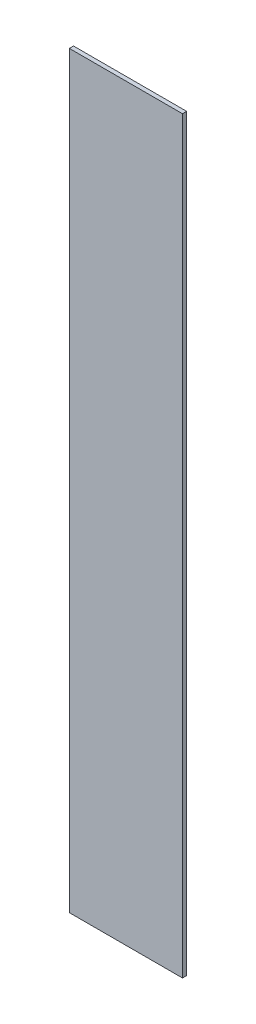
ISO-10303-21;
HEADER;
FILE_DESCRIPTION(('STEP AP214'),'2;1');
FILE_NAME('part.step','',(''),(''),'','','');
FILE_SCHEMA(('AUTOMOTIVE_DESIGN { 1 0 10303 214 1 1 1 1 }'));
ENDSEC;
DATA;
#1=APPLICATION_CONTEXT('core data for automotive mechanical design processes');
#2=APPLICATION_PROTOCOL_DEFINITION('international standard','automotive_design',2000,#1);
#3=PRODUCT_CONTEXT('',#1,'mechanical');
#4=PRODUCT('Part','Part','',(#3));
#5=PRODUCT_RELATED_PRODUCT_CATEGORY('part','',(#4));
#6=PRODUCT_DEFINITION_FORMATION('','',#4);
#7=PRODUCT_DEFINITION_CONTEXT('part definition',#1,'design');
#8=PRODUCT_DEFINITION('design','',#6,#7);
#9=PRODUCT_DEFINITION_SHAPE('','',#8);
#10=(LENGTH_UNIT() NAMED_UNIT(*) SI_UNIT(.MILLI.,.METRE.));
#11=(NAMED_UNIT(*) PLANE_ANGLE_UNIT() SI_UNIT($,.RADIAN.));
#12=(NAMED_UNIT(*) SI_UNIT($,.STERADIAN.) SOLID_ANGLE_UNIT());
#13=UNCERTAINTY_MEASURE_WITH_UNIT(LENGTH_MEASURE(1.E-05),#10,'distance_accuracy_value','');
#14=(GEOMETRIC_REPRESENTATION_CONTEXT(3) GLOBAL_UNCERTAINTY_ASSIGNED_CONTEXT((#13)) GLOBAL_UNIT_ASSIGNED_CONTEXT((#10,
#11,#12)) REPRESENTATION_CONTEXT('',''));
#15=CARTESIAN_POINT('',(0.,0.,0.));
#16=DIRECTION('',(0.,0.,1.));
#17=DIRECTION('',(1.,0.,0.));
#18=AXIS2_PLACEMENT_3D('',#15,#16,#17);
#19=CARTESIAN_POINT('',(0.,0.,3.175));
#20=DIRECTION('',(1.,0.,0.));
#21=DIRECTION('',(0.,0.,-1.));
#22=AXIS2_PLACEMENT_3D('',#19,#20,#21);
#23=PLANE('',#22);
#24=DIRECTION('',(0.,-1.,0.));
#25=VECTOR('',#24,1.);
#26=CARTESIAN_POINT('',(0.,0.,0.));
#27=LINE('',#26,#25);
#28=CARTESIAN_POINT('',(0.,571.5,0.));
#29=VERTEX_POINT('',#28);
#30=CARTESIAN_POINT('',(0.,0.,0.));
#31=VERTEX_POINT('',#30);
#32=EDGE_CURVE('E103',#29,#31,#27,.T.);
#33=ORIENTED_EDGE('',*,*,#32,.T.);
#34=DIRECTION('',(0.,0.,-1.));
#35=VECTOR('',#34,1.);
#36=CARTESIAN_POINT('',(0.,0.,3.175));
#37=LINE('',#36,#35);
#38=CARTESIAN_POINT('',(0.,0.,3.175));
#39=VERTEX_POINT('',#38);
#40=EDGE_CURVE('E11',#39,#31,#37,.T.);
#41=ORIENTED_EDGE('',*,*,#40,.F.);
#42=DIRECTION('',(0.,-1.,0.));
#43=VECTOR('',#42,1.);
#44=CARTESIAN_POINT('',(0.,0.,3.175));
#45=LINE('',#44,#43);
#46=CARTESIAN_POINT('',(0.,571.5,3.175));
#47=VERTEX_POINT('',#46);
#48=EDGE_CURVE('E91',#47,#39,#45,.T.);
#49=ORIENTED_EDGE('',*,*,#48,.F.);
#50=DIRECTION('',(0.,0.,-1.));
#51=VECTOR('',#50,1.);
#52=CARTESIAN_POINT('',(0.,571.5,3.175));
#53=LINE('',#52,#51);
#54=EDGE_CURVE('E99',#47,#29,#53,.T.);
#55=ORIENTED_EDGE('',*,*,#54,.T.);
#56=EDGE_LOOP('',(#33,#41,#49,#55));
#57=FACE_BOUND('',#56,.T.);
#58=ADVANCED_FACE('F40',(#57),#23,.F.);
#59=CARTESIAN_POINT('',(0.,0.,3.175));
#60=DIRECTION('',(0.,1.,0.));
#61=DIRECTION('',(0.,0.,1.));
#62=AXIS2_PLACEMENT_3D('',#59,#60,#61);
#63=PLANE('',#62);
#64=DIRECTION('',(1.,0.,0.));
#65=VECTOR('',#64,1.);
#66=CARTESIAN_POINT('',(0.,0.,0.));
#67=LINE('',#66,#65);
#68=CARTESIAN_POINT('',(86.36,0.,0.));
#69=VERTEX_POINT('',#68);
#70=EDGE_CURVE('E95',#31,#69,#67,.T.);
#71=ORIENTED_EDGE('',*,*,#70,.T.);
#72=DIRECTION('',(0.,0.,-1.));
#73=VECTOR('',#72,1.);
#74=CARTESIAN_POINT('',(86.36,0.,3.175));
#75=LINE('',#74,#73);
#76=CARTESIAN_POINT('',(86.36,0.,3.175));
#77=VERTEX_POINT('',#76);
#78=EDGE_CURVE('E48',#77,#69,#75,.T.);
#79=ORIENTED_EDGE('',*,*,#78,.F.);
#80=DIRECTION('',(1.,0.,0.));
#81=VECTOR('',#80,1.);
#82=CARTESIAN_POINT('',(0.,0.,3.175));
#83=LINE('',#82,#81);
#84=EDGE_CURVE('E86',#39,#77,#83,.T.);
#85=ORIENTED_EDGE('',*,*,#84,.F.);
#86=ORIENTED_EDGE('',*,*,#40,.T.);
#87=EDGE_LOOP('',(#71,#79,#85,#86));
#88=FACE_BOUND('',#87,.T.);
#89=ADVANCED_FACE('F94',(#88),#63,.F.);
#90=CARTESIAN_POINT('',(86.36,0.,3.175));
#91=DIRECTION('',(-1.,0.,0.));
#92=DIRECTION('',(0.,0.,1.));
#93=AXIS2_PLACEMENT_3D('',#90,#91,#92);
#94=PLANE('',#93);
#95=DIRECTION('',(0.,1.,0.));
#96=VECTOR('',#95,1.);
#97=CARTESIAN_POINT('',(86.36,0.,0.));
#98=LINE('',#97,#96);
#99=CARTESIAN_POINT('',(86.36,571.5,0.));
#100=VERTEX_POINT('',#99);
#101=EDGE_CURVE('E73',#69,#100,#98,.T.);
#102=ORIENTED_EDGE('',*,*,#101,.T.);
#103=DIRECTION('',(0.,0.,-1.));
#104=VECTOR('',#103,1.);
#105=CARTESIAN_POINT('',(86.36,571.5,3.175));
#106=LINE('',#105,#104);
#107=CARTESIAN_POINT('',(86.36,571.5,3.175));
#108=VERTEX_POINT('',#107);
#109=EDGE_CURVE('E96',#108,#100,#106,.T.);
#110=ORIENTED_EDGE('',*,*,#109,.F.);
#111=DIRECTION('',(0.,1.,0.));
#112=VECTOR('',#111,1.);
#113=CARTESIAN_POINT('',(86.36,0.,3.175));
#114=LINE('',#113,#112);
#115=EDGE_CURVE('E89',#77,#108,#114,.T.);
#116=ORIENTED_EDGE('',*,*,#115,.F.);
#117=ORIENTED_EDGE('',*,*,#78,.T.);
#118=EDGE_LOOP('',(#102,#110,#116,#117));
#119=FACE_BOUND('',#118,.T.);
#120=ADVANCED_FACE('F97',(#119),#94,.F.);
#121=CARTESIAN_POINT('',(0.,571.5,3.175));
#122=DIRECTION('',(0.,-1.,0.));
#123=DIRECTION('',(0.,0.,-1.));
#124=AXIS2_PLACEMENT_3D('',#121,#122,#123);
#125=PLANE('',#124);
#126=DIRECTION('',(-1.,0.,0.));
#127=VECTOR('',#126,1.);
#128=CARTESIAN_POINT('',(0.,571.5,0.));
#129=LINE('',#128,#127);
#130=EDGE_CURVE('E79',#100,#29,#129,.T.);
#131=ORIENTED_EDGE('',*,*,#130,.T.);
#132=ORIENTED_EDGE('',*,*,#54,.F.);
#133=DIRECTION('',(-1.,0.,0.));
#134=VECTOR('',#133,1.);
#135=CARTESIAN_POINT('',(0.,571.5,3.175));
#136=LINE('',#135,#134);
#137=EDGE_CURVE('E56',#108,#47,#136,.T.);
#138=ORIENTED_EDGE('',*,*,#137,.F.);
#139=ORIENTED_EDGE('',*,*,#109,.T.);
#140=EDGE_LOOP('',(#131,#132,#138,#139));
#141=FACE_BOUND('',#140,.T.);
#142=ADVANCED_FACE('F110',(#141),#125,.F.);
#143=CARTESIAN_POINT('',(0.,0.,3.175));
#144=DIRECTION('',(0.,0.,-1.));
#145=DIRECTION('',(-1.,0.,0.));
#146=AXIS2_PLACEMENT_3D('',#143,#144,#145);
#147=PLANE('',#146);
#148=ORIENTED_EDGE('',*,*,#48,.T.);
#149=ORIENTED_EDGE('',*,*,#84,.T.);
#150=ORIENTED_EDGE('',*,*,#115,.T.);
#151=ORIENTED_EDGE('',*,*,#137,.T.);
#152=EDGE_LOOP('',(#148,#149,#150,#151));
#153=FACE_BOUND('',#152,.T.);
#154=ADVANCED_FACE('F87',(#153),#147,.F.);
#155=CARTESIAN_POINT('',(0.,0.,0.));
#156=DIRECTION('',(0.,0.,-1.));
#157=DIRECTION('',(-1.,0.,0.));
#158=AXIS2_PLACEMENT_3D('',#155,#156,#157);
#159=PLANE('',#158);
#160=ORIENTED_EDGE('',*,*,#32,.F.);
#161=ORIENTED_EDGE('',*,*,#130,.F.);
#162=ORIENTED_EDGE('',*,*,#101,.F.);
#163=ORIENTED_EDGE('',*,*,#70,.F.);
#164=EDGE_LOOP('',(#160,#161,#162,#163));
#165=FACE_BOUND('',#164,.T.);
#166=ADVANCED_FACE('F113',(#165),#159,.T.);
#167=CLOSED_SHELL('',(#58,#89,#120,#142,#154,#166));
#168=MANIFOLD_SOLID_BREP('B2',#167);
#169=ADVANCED_BREP_SHAPE_REPRESENTATION('',(#18,#168),#14);
#170=SHAPE_DEFINITION_REPRESENTATION(#9,#169);
ENDSEC;
END-ISO-10303-21;
